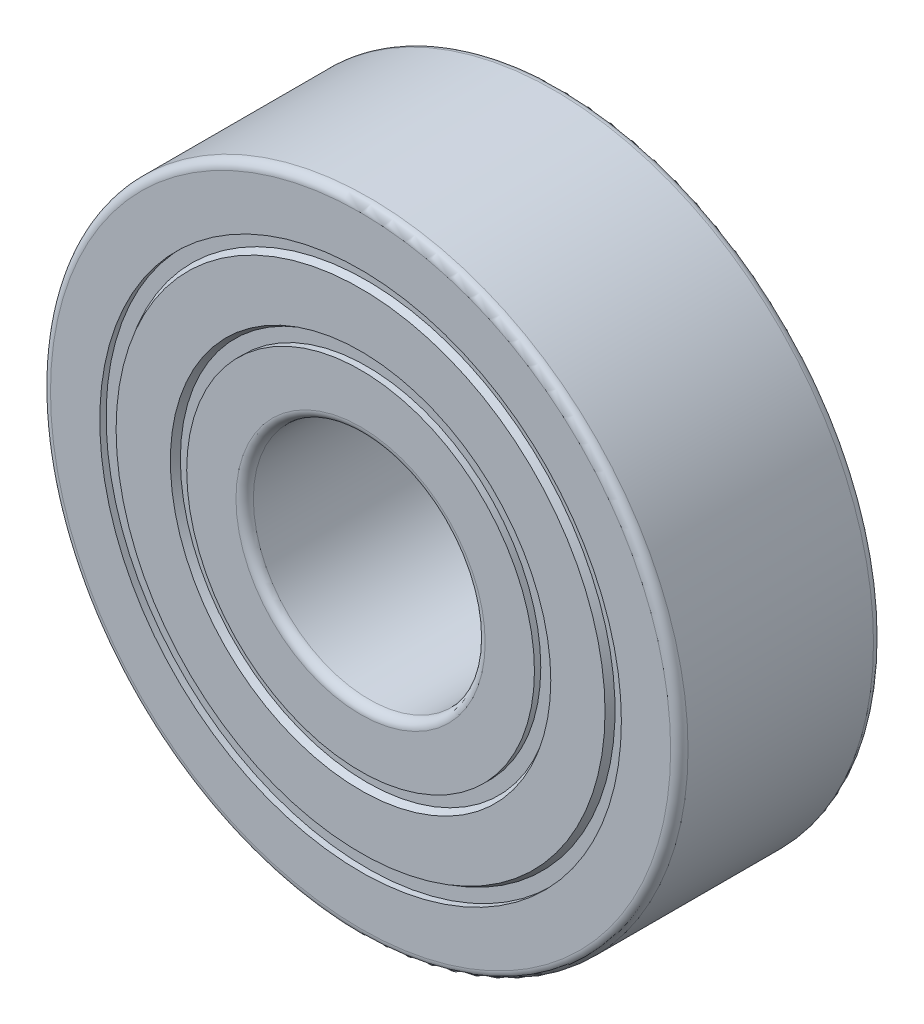
ISO-10303-21;
HEADER;
FILE_DESCRIPTION(('STEP AP214'),'2;1');
FILE_NAME('part.step','',(''),(''),'','','');
FILE_SCHEMA(('AUTOMOTIVE_DESIGN { 1 0 10303 214 1 1 1 1 }'));
ENDSEC;
DATA;
#1=APPLICATION_CONTEXT('core data for automotive mechanical design processes');
#2=APPLICATION_PROTOCOL_DEFINITION('international standard','automotive_design',2000,#1);
#3=PRODUCT_CONTEXT('',#1,'mechanical');
#4=PRODUCT('Part','Part','',(#3));
#5=PRODUCT_RELATED_PRODUCT_CATEGORY('part','',(#4));
#6=PRODUCT_DEFINITION_FORMATION('','',#4);
#7=PRODUCT_DEFINITION_CONTEXT('part definition',#1,'design');
#8=PRODUCT_DEFINITION('design','',#6,#7);
#9=PRODUCT_DEFINITION_SHAPE('','',#8);
#10=(LENGTH_UNIT() NAMED_UNIT(*) SI_UNIT(.MILLI.,.METRE.));
#11=(NAMED_UNIT(*) PLANE_ANGLE_UNIT() SI_UNIT($,.RADIAN.));
#12=(NAMED_UNIT(*) SI_UNIT($,.STERADIAN.) SOLID_ANGLE_UNIT());
#13=UNCERTAINTY_MEASURE_WITH_UNIT(LENGTH_MEASURE(1.E-05),#10,'distance_accuracy_value','');
#14=(GEOMETRIC_REPRESENTATION_CONTEXT(3) GLOBAL_UNCERTAINTY_ASSIGNED_CONTEXT((#13)) GLOBAL_UNIT_ASSIGNED_CONTEXT((#10,
#11,#12)) REPRESENTATION_CONTEXT('',''));
#15=CARTESIAN_POINT('',(0.,0.,0.));
#16=DIRECTION('',(0.,0.,1.));
#17=DIRECTION('',(1.,0.,0.));
#18=AXIS2_PLACEMENT_3D('',#15,#16,#17);
#19=CARTESIAN_POINT('',(0.,0.,19.));
#20=DIRECTION('',(0.,0.,1.));
#21=DIRECTION('',(1.,0.,0.));
#22=AXIS2_PLACEMENT_3D('',#19,#20,#21);
#23=CYLINDRICAL_SURFACE('',#22,4.);
#24=CARTESIAN_POINT('',(0.,0.,6.7));
#25=DIRECTION('',(0.,0.,1.));
#26=DIRECTION('',(1.,0.,0.));
#27=AXIS2_PLACEMENT_3D('',#24,#25,#26);
#28=CIRCLE('',#27,4.);
#29=CARTESIAN_POINT('',(4.,0.,6.7));
#30=VERTEX_POINT('',#29);
#31=EDGE_CURVE('E179',#30,#30,#28,.F.);
#32=ORIENTED_EDGE('',*,*,#31,.F.);
#33=EDGE_LOOP('',(#32));
#34=FACE_BOUND('',#33,.T.);
#35=CARTESIAN_POINT('',(0.,0.,0.300000000000002));
#36=DIRECTION('',(0.,0.,1.));
#37=DIRECTION('',(1.,0.,0.));
#38=AXIS2_PLACEMENT_3D('',#35,#36,#37);
#39=CIRCLE('',#38,4.);
#40=CARTESIAN_POINT('',(4.,0.,0.300000000000002));
#41=VERTEX_POINT('',#40);
#42=EDGE_CURVE('E176',#41,#41,#39,.T.);
#43=ORIENTED_EDGE('',*,*,#42,.F.);
#44=EDGE_LOOP('',(#43));
#45=FACE_BOUND('',#44,.T.);
#46=ADVANCED_FACE('F15',(#34,#45),#23,.F.);
#47=CARTESIAN_POINT('',(0.,0.,6.7));
#48=DIRECTION('',(0.,0.,1.));
#49=DIRECTION('',(1.,0.,0.));
#50=AXIS2_PLACEMENT_3D('',#47,#48,#49);
#51=TOROIDAL_SURFACE('',#50,4.3,0.3);
#52=CARTESIAN_POINT('',(0.,0.,7.));
#53=DIRECTION('',(0.,0.,1.));
#54=DIRECTION('',(-1.,0.,0.));
#55=AXIS2_PLACEMENT_3D('',#52,#53,#54);
#56=CIRCLE('',#55,4.3);
#57=CARTESIAN_POINT('',(-4.3,0.,7.));
#58=VERTEX_POINT('',#57);
#59=EDGE_CURVE('E175',#58,#58,#56,.T.);
#60=ORIENTED_EDGE('',*,*,#59,.T.);
#61=EDGE_LOOP('',(#60));
#62=FACE_BOUND('',#61,.T.);
#63=ORIENTED_EDGE('',*,*,#31,.T.);
#64=EDGE_LOOP('',(#63));
#65=FACE_BOUND('',#64,.T.);
#66=ADVANCED_FACE('F187',(#62,#65),#51,.T.);
#67=CARTESIAN_POINT('',(0.,0.,0.300000000000001));
#68=DIRECTION('',(0.,0.,1.));
#69=DIRECTION('',(1.,0.,0.));
#70=AXIS2_PLACEMENT_3D('',#67,#68,#69);
#71=TOROIDAL_SURFACE('',#70,4.3,0.3);
#72=ORIENTED_EDGE('',*,*,#42,.T.);
#73=EDGE_LOOP('',(#72));
#74=FACE_BOUND('',#73,.T.);
#75=CARTESIAN_POINT('',(0.,0.,0.));
#76=DIRECTION('',(0.,0.,-1.));
#77=DIRECTION('',(1.,0.,0.));
#78=AXIS2_PLACEMENT_3D('',#75,#76,#77);
#79=CIRCLE('',#78,4.3);
#80=CARTESIAN_POINT('',(4.3,0.,0.));
#81=VERTEX_POINT('',#80);
#82=EDGE_CURVE('E162',#81,#81,#79,.T.);
#83=ORIENTED_EDGE('',*,*,#82,.T.);
#84=EDGE_LOOP('',(#83));
#85=FACE_BOUND('',#84,.T.);
#86=ADVANCED_FACE('F183',(#74,#85),#71,.T.);
#87=CARTESIAN_POINT('',(-4.3,0.,7.));
#88=DIRECTION('',(0.,0.,-1.));
#89=DIRECTION('',(-1.,0.,0.));
#90=AXIS2_PLACEMENT_3D('',#87,#88,#89);
#91=PLANE('',#90);
#92=CARTESIAN_POINT('',(0.,0.,7.));
#93=DIRECTION('',(0.,0.,1.));
#94=DIRECTION('',(1.,0.,0.));
#95=AXIS2_PLACEMENT_3D('',#92,#93,#94);
#96=CIRCLE('',#95,6.);
#97=CARTESIAN_POINT('',(6.,0.,7.));
#98=VERTEX_POINT('',#97);
#99=EDGE_CURVE('E19',#98,#98,#96,.F.);
#100=ORIENTED_EDGE('',*,*,#99,.F.);
#101=EDGE_LOOP('',(#100));
#102=FACE_BOUND('',#101,.T.);
#103=ORIENTED_EDGE('',*,*,#59,.F.);
#104=EDGE_LOOP('',(#103));
#105=FACE_BOUND('',#104,.T.);
#106=ADVANCED_FACE('F147',(#102,#105),#91,.F.);
#107=CARTESIAN_POINT('',(-4.3,0.,0.));
#108=DIRECTION('',(0.,0.,1.));
#109=DIRECTION('',(1.,0.,0.));
#110=AXIS2_PLACEMENT_3D('',#107,#108,#109);
#111=PLANE('',#110);
#112=ORIENTED_EDGE('',*,*,#82,.F.);
#113=EDGE_LOOP('',(#112));
#114=FACE_BOUND('',#113,.T.);
#115=CARTESIAN_POINT('',(0.,0.,0.));
#116=DIRECTION('',(0.,0.,1.));
#117=DIRECTION('',(1.,0.,0.));
#118=AXIS2_PLACEMENT_3D('',#115,#116,#117);
#119=CIRCLE('',#118,6.);
#120=CARTESIAN_POINT('',(6.,0.,0.));
#121=VERTEX_POINT('',#120);
#122=EDGE_CURVE('E253',#121,#121,#119,.T.);
#123=ORIENTED_EDGE('',*,*,#122,.F.);
#124=EDGE_LOOP('',(#123));
#125=FACE_BOUND('',#124,.T.);
#126=ADVANCED_FACE('F142',(#114,#125),#111,.F.);
#127=CARTESIAN_POINT('',(0.,0.,19.));
#128=DIRECTION('',(0.,0.,1.));
#129=DIRECTION('',(1.,0.,0.));
#130=AXIS2_PLACEMENT_3D('',#127,#128,#129);
#131=CYLINDRICAL_SURFACE('',#130,6.);
#132=ORIENTED_EDGE('',*,*,#99,.T.);
#133=EDGE_LOOP('',(#132));
#134=FACE_BOUND('',#133,.T.);
#135=CARTESIAN_POINT('',(0.,0.,6.78125));
#136=DIRECTION('',(0.,0.,1.));
#137=DIRECTION('',(1.,0.,0.));
#138=AXIS2_PLACEMENT_3D('',#135,#136,#137);
#139=CIRCLE('',#138,6.);
#140=CARTESIAN_POINT('',(6.,0.,6.78125));
#141=VERTEX_POINT('',#140);
#142=EDGE_CURVE('E251',#141,#141,#139,.T.);
#143=ORIENTED_EDGE('',*,*,#142,.T.);
#144=EDGE_LOOP('',(#143));
#145=FACE_BOUND('',#144,.T.);
#146=ADVANCED_FACE('F138',(#134,#145),#131,.T.);
#147=CARTESIAN_POINT('',(0.,0.,19.));
#148=DIRECTION('',(0.,0.,1.));
#149=DIRECTION('',(1.,0.,0.));
#150=AXIS2_PLACEMENT_3D('',#147,#148,#149);
#151=CYLINDRICAL_SURFACE('',#150,6.);
#152=ORIENTED_EDGE('',*,*,#122,.T.);
#153=EDGE_LOOP('',(#152));
#154=FACE_BOUND('',#153,.T.);
#155=CARTESIAN_POINT('',(0.,0.,0.21875));
#156=DIRECTION('',(0.,0.,1.));
#157=DIRECTION('',(1.,0.,0.));
#158=AXIS2_PLACEMENT_3D('',#155,#156,#157);
#159=CIRCLE('',#158,6.);
#160=CARTESIAN_POINT('',(6.,0.,0.21875));
#161=VERTEX_POINT('',#160);
#162=EDGE_CURVE('E248',#161,#161,#159,.F.);
#163=ORIENTED_EDGE('',*,*,#162,.T.);
#164=EDGE_LOOP('',(#163));
#165=FACE_BOUND('',#164,.T.);
#166=ADVANCED_FACE('F134',(#154,#165),#151,.T.);
#167=CARTESIAN_POINT('',(-6.,0.,6.78125));
#168=DIRECTION('',(0.,0.,-1.));
#169=DIRECTION('',(-1.,0.,0.));
#170=AXIS2_PLACEMENT_3D('',#167,#168,#169);
#171=PLANE('',#170);
#172=CARTESIAN_POINT('',(0.,0.,6.78125000001728));
#173=DIRECTION('',(0.,0.,1.));
#174=DIRECTION('',(1.,0.,0.));
#175=AXIS2_PLACEMENT_3D('',#172,#173,#174);
#176=CIRCLE('',#175,6.43750000000409);
#177=CARTESIAN_POINT('',(6.43750000000409,0.,6.78125000001728));
#178=VERTEX_POINT('',#177);
#179=EDGE_CURVE('E245',#178,#178,#176,.T.);
#180=ORIENTED_EDGE('',*,*,#179,.T.);
#181=EDGE_LOOP('',(#180));
#182=FACE_BOUND('',#181,.T.);
#183=ORIENTED_EDGE('',*,*,#142,.F.);
#184=EDGE_LOOP('',(#183));
#185=FACE_BOUND('',#184,.T.);
#186=ADVANCED_FACE('F130',(#182,#185),#171,.F.);
#187=CARTESIAN_POINT('',(-6.,0.,0.21875));
#188=DIRECTION('',(0.,0.,1.));
#189=DIRECTION('',(1.,0.,0.));
#190=AXIS2_PLACEMENT_3D('',#187,#188,#189);
#191=PLANE('',#190);
#192=ORIENTED_EDGE('',*,*,#162,.F.);
#193=EDGE_LOOP('',(#192));
#194=FACE_BOUND('',#193,.T.);
#195=CARTESIAN_POINT('',(0.,0.,0.218750000044565));
#196=DIRECTION('',(0.,0.,-1.));
#197=DIRECTION('',(-1.,0.,0.));
#198=AXIS2_PLACEMENT_3D('',#195,#196,#197);
#199=CIRCLE('',#198,6.43749999998007);
#200=CARTESIAN_POINT('',(-6.43749999998007,0.,0.218750000044565));
#201=VERTEX_POINT('',#200);
#202=EDGE_CURVE('E242',#201,#201,#199,.T.);
#203=ORIENTED_EDGE('',*,*,#202,.T.);
#204=EDGE_LOOP('',(#203));
#205=FACE_BOUND('',#204,.T.);
#206=ADVANCED_FACE('F126',(#194,#205),#191,.F.);
#207=CARTESIAN_POINT('',(0.,0.,7.000000000005));
#208=DIRECTION('',(0.,0.,1.));
#209=DIRECTION('',(1.,0.,0.));
#210=AXIS2_PLACEMENT_3D('',#207,#208,#209);
#211=CONICAL_SURFACE('',#210,6.56379537139173,0.523598775630869);
#212=CARTESIAN_POINT('',(0.,0.,7.000000000005));
#213=DIRECTION('',(0.,0.,1.));
#214=DIRECTION('',(1.,0.,0.));
#215=AXIS2_PLACEMENT_3D('',#212,#213,#214);
#216=CIRCLE('',#215,6.56379537139173);
#217=CARTESIAN_POINT('',(6.56379537139173,0.,7.000000000005));
#218=VERTEX_POINT('',#217);
#219=EDGE_CURVE('E239',#218,#218,#216,.T.);
#220=ORIENTED_EDGE('',*,*,#219,.T.);
#221=EDGE_LOOP('',(#220));
#222=FACE_BOUND('',#221,.T.);
#223=ORIENTED_EDGE('',*,*,#179,.F.);
#224=EDGE_LOOP('',(#223));
#225=FACE_BOUND('',#224,.T.);
#226=ADVANCED_FACE('F122',(#222,#225),#211,.F.);
#227=CARTESIAN_POINT('',(0.,0.,0.));
#228=DIRECTION('',(0.,0.,-1.));
#229=DIRECTION('',(-1.,0.,0.));
#230=AXIS2_PLACEMENT_3D('',#227,#228,#229);
#231=CONICAL_SURFACE('',#230,6.56379537139173,0.523598775600719);
#232=ORIENTED_EDGE('',*,*,#202,.F.);
#233=EDGE_LOOP('',(#232));
#234=FACE_BOUND('',#233,.T.);
#235=CARTESIAN_POINT('',(0.,0.,0.));
#236=DIRECTION('',(0.,0.,-1.));
#237=DIRECTION('',(-1.,0.,0.));
#238=AXIS2_PLACEMENT_3D('',#235,#236,#237);
#239=CIRCLE('',#238,6.56379537139173);
#240=CARTESIAN_POINT('',(-6.56379537139173,0.,0.));
#241=VERTEX_POINT('',#240);
#242=EDGE_CURVE('E236',#241,#241,#239,.T.);
#243=ORIENTED_EDGE('',*,*,#242,.T.);
#244=EDGE_LOOP('',(#243));
#245=FACE_BOUND('',#244,.T.);
#246=ADVANCED_FACE('F118',(#234,#245),#231,.F.);
#247=CARTESIAN_POINT('',(-8.43620462861477,0.,7.));
#248=DIRECTION('',(0.,0.,-1.));
#249=DIRECTION('',(-1.,0.,0.));
#250=AXIS2_PLACEMENT_3D('',#247,#248,#249);
#251=PLANE('',#250);
#252=CARTESIAN_POINT('',(0.,0.,7.));
#253=DIRECTION('',(0.,0.,-1.));
#254=DIRECTION('',(-1.,0.,0.));
#255=AXIS2_PLACEMENT_3D('',#252,#253,#254);
#256=CIRCLE('',#255,8.43620462861477);
#257=CARTESIAN_POINT('',(-8.43620462861477,0.,7.));
#258=VERTEX_POINT('',#257);
#259=EDGE_CURVE('E233',#258,#258,#256,.T.);
#260=ORIENTED_EDGE('',*,*,#259,.F.);
#261=EDGE_LOOP('',(#260));
#262=FACE_BOUND('',#261,.T.);
#263=ORIENTED_EDGE('',*,*,#219,.F.);
#264=EDGE_LOOP('',(#263));
#265=FACE_BOUND('',#264,.T.);
#266=ADVANCED_FACE('F114',(#262,#265),#251,.F.);
#267=CARTESIAN_POINT('',(-8.43620462861477,0.,0.));
#268=DIRECTION('',(0.,0.,1.));
#269=DIRECTION('',(1.,0.,0.));
#270=AXIS2_PLACEMENT_3D('',#267,#268,#269);
#271=PLANE('',#270);
#272=ORIENTED_EDGE('',*,*,#242,.F.);
#273=EDGE_LOOP('',(#272));
#274=FACE_BOUND('',#273,.T.);
#275=CARTESIAN_POINT('',(0.,0.,0.));
#276=DIRECTION('',(0.,0.,1.));
#277=DIRECTION('',(1.,0.,0.));
#278=AXIS2_PLACEMENT_3D('',#275,#276,#277);
#279=CIRCLE('',#278,8.43620462861477);
#280=CARTESIAN_POINT('',(8.43620462861477,0.,0.));
#281=VERTEX_POINT('',#280);
#282=EDGE_CURVE('E230',#281,#281,#279,.T.);
#283=ORIENTED_EDGE('',*,*,#282,.F.);
#284=EDGE_LOOP('',(#283));
#285=FACE_BOUND('',#284,.T.);
#286=ADVANCED_FACE('F110',(#274,#285),#271,.F.);
#287=CARTESIAN_POINT('',(0.,0.,6.78125));
#288=DIRECTION('',(0.,0.,-1.));
#289=DIRECTION('',(-1.,0.,0.));
#290=AXIS2_PLACEMENT_3D('',#287,#288,#289);
#291=CONICAL_SURFACE('',#290,8.5625,0.523598775598308);
#292=CARTESIAN_POINT('',(0.,0.,6.78125));
#293=DIRECTION('',(0.,0.,-1.));
#294=DIRECTION('',(-1.,0.,0.));
#295=AXIS2_PLACEMENT_3D('',#292,#293,#294);
#296=CIRCLE('',#295,8.5625);
#297=CARTESIAN_POINT('',(-8.5625,0.,6.78125));
#298=VERTEX_POINT('',#297);
#299=EDGE_CURVE('E227',#298,#298,#296,.F.);
#300=ORIENTED_EDGE('',*,*,#299,.T.);
#301=EDGE_LOOP('',(#300));
#302=FACE_BOUND('',#301,.T.);
#303=ORIENTED_EDGE('',*,*,#259,.T.);
#304=EDGE_LOOP('',(#303));
#305=FACE_BOUND('',#304,.T.);
#306=ADVANCED_FACE('F106',(#302,#305),#291,.T.);
#307=CARTESIAN_POINT('',(0.,0.,0.21875));
#308=DIRECTION('',(0.,0.,1.));
#309=DIRECTION('',(1.,0.,0.));
#310=AXIS2_PLACEMENT_3D('',#307,#308,#309);
#311=CONICAL_SURFACE('',#310,8.5625,0.523598775598309);
#312=ORIENTED_EDGE('',*,*,#282,.T.);
#313=EDGE_LOOP('',(#312));
#314=FACE_BOUND('',#313,.T.);
#315=CARTESIAN_POINT('',(0.,0.,0.21875));
#316=DIRECTION('',(0.,0.,1.));
#317=DIRECTION('',(1.,0.,0.));
#318=AXIS2_PLACEMENT_3D('',#315,#316,#317);
#319=CIRCLE('',#318,8.5625);
#320=CARTESIAN_POINT('',(8.5625,0.,0.21875));
#321=VERTEX_POINT('',#320);
#322=EDGE_CURVE('E224',#321,#321,#319,.F.);
#323=ORIENTED_EDGE('',*,*,#322,.T.);
#324=EDGE_LOOP('',(#323));
#325=FACE_BOUND('',#324,.T.);
#326=ADVANCED_FACE('F102',(#314,#325),#311,.T.);
#327=CARTESIAN_POINT('',(-9.,0.,6.78125));
#328=DIRECTION('',(0.,0.,-1.));
#329=DIRECTION('',(-1.,0.,0.));
#330=AXIS2_PLACEMENT_3D('',#327,#328,#329);
#331=PLANE('',#330);
#332=CARTESIAN_POINT('',(0.,0.,6.78125));
#333=DIRECTION('',(0.,0.,1.));
#334=DIRECTION('',(1.,0.,0.));
#335=AXIS2_PLACEMENT_3D('',#332,#333,#334);
#336=CIRCLE('',#335,9.);
#337=CARTESIAN_POINT('',(9.,0.,6.78125));
#338=VERTEX_POINT('',#337);
#339=EDGE_CURVE('E221',#338,#338,#336,.T.);
#340=ORIENTED_EDGE('',*,*,#339,.T.);
#341=EDGE_LOOP('',(#340));
#342=FACE_BOUND('',#341,.T.);
#343=ORIENTED_EDGE('',*,*,#299,.F.);
#344=EDGE_LOOP('',(#343));
#345=FACE_BOUND('',#344,.T.);
#346=ADVANCED_FACE('F98',(#342,#345),#331,.F.);
#347=CARTESIAN_POINT('',(-9.,0.,0.21875));
#348=DIRECTION('',(0.,0.,1.));
#349=DIRECTION('',(1.,0.,0.));
#350=AXIS2_PLACEMENT_3D('',#347,#348,#349);
#351=PLANE('',#350);
#352=ORIENTED_EDGE('',*,*,#322,.F.);
#353=EDGE_LOOP('',(#352));
#354=FACE_BOUND('',#353,.T.);
#355=CARTESIAN_POINT('',(0.,0.,0.21875));
#356=DIRECTION('',(0.,0.,1.));
#357=DIRECTION('',(1.,0.,0.));
#358=AXIS2_PLACEMENT_3D('',#355,#356,#357);
#359=CIRCLE('',#358,9.);
#360=CARTESIAN_POINT('',(9.,0.,0.21875));
#361=VERTEX_POINT('',#360);
#362=EDGE_CURVE('E218',#361,#361,#359,.F.);
#363=ORIENTED_EDGE('',*,*,#362,.T.);
#364=EDGE_LOOP('',(#363));
#365=FACE_BOUND('',#364,.T.);
#366=ADVANCED_FACE('F94',(#354,#365),#351,.F.);
#367=CARTESIAN_POINT('',(0.,0.,19.));
#368=DIRECTION('',(0.,0.,1.));
#369=DIRECTION('',(1.,0.,0.));
#370=AXIS2_PLACEMENT_3D('',#367,#368,#369);
#371=CYLINDRICAL_SURFACE('',#370,9.);
#372=CARTESIAN_POINT('',(0.,0.,7.));
#373=DIRECTION('',(0.,0.,1.));
#374=DIRECTION('',(1.,0.,0.));
#375=AXIS2_PLACEMENT_3D('',#372,#373,#374);
#376=CIRCLE('',#375,9.);
#377=CARTESIAN_POINT('',(9.,0.,7.));
#378=VERTEX_POINT('',#377);
#379=EDGE_CURVE('E215',#378,#378,#376,.T.);
#380=ORIENTED_EDGE('',*,*,#379,.T.);
#381=EDGE_LOOP('',(#380));
#382=FACE_BOUND('',#381,.T.);
#383=ORIENTED_EDGE('',*,*,#339,.F.);
#384=EDGE_LOOP('',(#383));
#385=FACE_BOUND('',#384,.T.);
#386=ADVANCED_FACE('F90',(#382,#385),#371,.F.);
#387=CARTESIAN_POINT('',(0.,0.,19.));
#388=DIRECTION('',(0.,0.,1.));
#389=DIRECTION('',(1.,0.,0.));
#390=AXIS2_PLACEMENT_3D('',#387,#388,#389);
#391=CYLINDRICAL_SURFACE('',#390,9.);
#392=ORIENTED_EDGE('',*,*,#362,.F.);
#393=EDGE_LOOP('',(#392));
#394=FACE_BOUND('',#393,.T.);
#395=CARTESIAN_POINT('',(0.,0.,0.));
#396=DIRECTION('',(0.,0.,1.));
#397=DIRECTION('',(1.,0.,0.));
#398=AXIS2_PLACEMENT_3D('',#395,#396,#397);
#399=CIRCLE('',#398,9.);
#400=CARTESIAN_POINT('',(9.,0.,0.));
#401=VERTEX_POINT('',#400);
#402=EDGE_CURVE('E206',#401,#401,#399,.F.);
#403=ORIENTED_EDGE('',*,*,#402,.T.);
#404=EDGE_LOOP('',(#403));
#405=FACE_BOUND('',#404,.T.);
#406=ADVANCED_FACE('F86',(#394,#405),#391,.F.);
#407=CARTESIAN_POINT('',(-9.,0.,7.));
#408=DIRECTION('',(0.,0.,-1.));
#409=DIRECTION('',(-1.,0.,0.));
#410=AXIS2_PLACEMENT_3D('',#407,#408,#409);
#411=PLANE('',#410);
#412=CARTESIAN_POINT('',(0.,0.,7.));
#413=DIRECTION('',(0.,0.,-1.));
#414=DIRECTION('',(1.,0.,0.));
#415=AXIS2_PLACEMENT_3D('',#412,#413,#414);
#416=CIRCLE('',#415,10.7);
#417=CARTESIAN_POINT('',(10.7,0.,7.));
#418=VERTEX_POINT('',#417);
#419=EDGE_CURVE('E214',#418,#418,#416,.T.);
#420=ORIENTED_EDGE('',*,*,#419,.F.);
#421=EDGE_LOOP('',(#420));
#422=FACE_BOUND('',#421,.T.);
#423=ORIENTED_EDGE('',*,*,#379,.F.);
#424=EDGE_LOOP('',(#423));
#425=FACE_BOUND('',#424,.T.);
#426=ADVANCED_FACE('F77',(#422,#425),#411,.F.);
#427=CARTESIAN_POINT('',(-9.,0.,0.));
#428=DIRECTION('',(0.,0.,1.));
#429=DIRECTION('',(1.,0.,0.));
#430=AXIS2_PLACEMENT_3D('',#427,#428,#429);
#431=PLANE('',#430);
#432=ORIENTED_EDGE('',*,*,#402,.F.);
#433=EDGE_LOOP('',(#432));
#434=FACE_BOUND('',#433,.T.);
#435=CARTESIAN_POINT('',(0.,0.,0.));
#436=DIRECTION('',(0.,0.,1.));
#437=DIRECTION('',(-1.,0.,0.));
#438=AXIS2_PLACEMENT_3D('',#435,#436,#437);
#439=CIRCLE('',#438,10.7);
#440=CARTESIAN_POINT('',(-10.7,0.,0.));
#441=VERTEX_POINT('',#440);
#442=EDGE_CURVE('E28',#441,#441,#439,.T.);
#443=ORIENTED_EDGE('',*,*,#442,.F.);
#444=EDGE_LOOP('',(#443));
#445=FACE_BOUND('',#444,.T.);
#446=ADVANCED_FACE('F56',(#434,#445),#431,.F.);
#447=CARTESIAN_POINT('',(0.,0.,6.7));
#448=DIRECTION('',(0.,0.,1.));
#449=DIRECTION('',(1.,0.,0.));
#450=AXIS2_PLACEMENT_3D('',#447,#448,#449);
#451=TOROIDAL_SURFACE('',#450,10.7,0.3);
#452=CARTESIAN_POINT('',(0.,0.,6.7));
#453=DIRECTION('',(0.,0.,1.));
#454=DIRECTION('',(1.,0.,0.));
#455=AXIS2_PLACEMENT_3D('',#452,#453,#454);
#456=CIRCLE('',#455,11.);
#457=CARTESIAN_POINT('',(11.,0.,6.7));
#458=VERTEX_POINT('',#457);
#459=EDGE_CURVE('E23',#458,#458,#456,.F.);
#460=ORIENTED_EDGE('',*,*,#459,.F.);
#461=EDGE_LOOP('',(#460));
#462=FACE_BOUND('',#461,.T.);
#463=ORIENTED_EDGE('',*,*,#419,.T.);
#464=EDGE_LOOP('',(#463));
#465=FACE_BOUND('',#464,.T.);
#466=ADVANCED_FACE('F52',(#462,#465),#451,.T.);
#467=CARTESIAN_POINT('',(0.,0.,0.299999999999999));
#468=DIRECTION('',(0.,0.,1.));
#469=DIRECTION('',(1.,0.,0.));
#470=AXIS2_PLACEMENT_3D('',#467,#468,#469);
#471=TOROIDAL_SURFACE('',#470,10.7,0.3);
#472=ORIENTED_EDGE('',*,*,#442,.T.);
#473=EDGE_LOOP('',(#472));
#474=FACE_BOUND('',#473,.T.);
#475=CARTESIAN_POINT('',(0.,0.,0.299999999999998));
#476=DIRECTION('',(0.,0.,1.));
#477=DIRECTION('',(1.,0.,0.));
#478=AXIS2_PLACEMENT_3D('',#475,#476,#477);
#479=CIRCLE('',#478,11.);
#480=CARTESIAN_POINT('',(11.,0.,0.299999999999998));
#481=VERTEX_POINT('',#480);
#482=EDGE_CURVE('E9',#481,#481,#479,.T.);
#483=ORIENTED_EDGE('',*,*,#482,.F.);
#484=EDGE_LOOP('',(#483));
#485=FACE_BOUND('',#484,.T.);
#486=ADVANCED_FACE('F43',(#474,#485),#471,.T.);
#487=CARTESIAN_POINT('',(0.,0.,19.));
#488=DIRECTION('',(0.,0.,1.));
#489=DIRECTION('',(1.,0.,0.));
#490=AXIS2_PLACEMENT_3D('',#487,#488,#489);
#491=CYLINDRICAL_SURFACE('',#490,11.);
#492=ORIENTED_EDGE('',*,*,#459,.T.);
#493=EDGE_LOOP('',(#492));
#494=FACE_BOUND('',#493,.T.);
#495=ORIENTED_EDGE('',*,*,#482,.T.);
#496=EDGE_LOOP('',(#495));
#497=FACE_BOUND('',#496,.T.);
#498=ADVANCED_FACE('F17',(#494,#497),#491,.T.);
#499=CLOSED_SHELL('',(#46,#66,#86,#106,#126,#146,#166,#186,#206,#226,#246,#266,#286,#306,#326,
#346,#366,#386,#406,#426,#446,#466,#486,#498));
#500=CARTESIAN_POINT('',(0.,0.,3.5));
#501=DIRECTION('',(0.,0.,1.));
#502=DIRECTION('',(1.,0.,0.));
#503=AXIS2_PLACEMENT_3D('',#500,#501,#502);
#504=TOROIDAL_SURFACE('',#503,7.5,2.1875);
#505=ADVANCED_FACE('F294',(),#504,.F.);
#506=CLOSED_SHELL('',(#505));
#507=ORIENTED_CLOSED_SHELL('',*,#506,.T.);
#508=BREP_WITH_VOIDS('B1',#499,(#507));
#509=ADVANCED_BREP_SHAPE_REPRESENTATION('',(#18,#508),#14);
#510=SHAPE_DEFINITION_REPRESENTATION(#9,#509);
ENDSEC;
END-ISO-10303-21;
